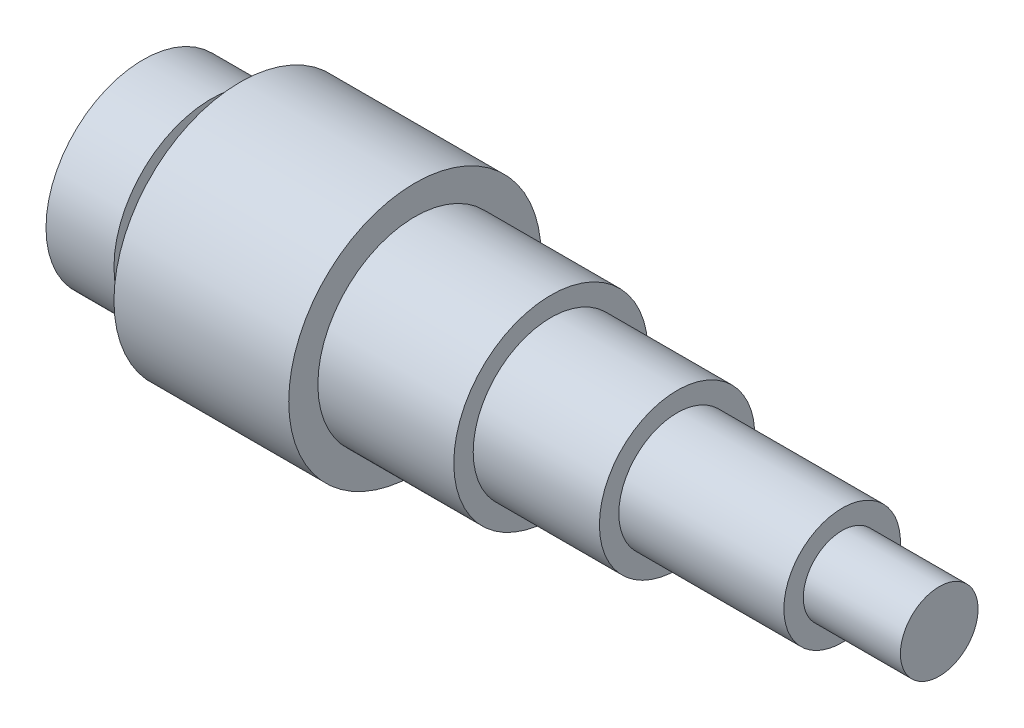
ISO-10303-21;
HEADER;
FILE_DESCRIPTION(('STEP AP214'),'2;1');
FILE_NAME('part.step','',(''),(''),'','','');
FILE_SCHEMA(('AUTOMOTIVE_DESIGN { 1 0 10303 214 1 1 1 1 }'));
ENDSEC;
DATA;
#1=APPLICATION_CONTEXT('core data for automotive mechanical design processes');
#2=APPLICATION_PROTOCOL_DEFINITION('international standard','automotive_design',2000,#1);
#3=PRODUCT_CONTEXT('',#1,'mechanical');
#4=PRODUCT('Part','Part','',(#3));
#5=PRODUCT_RELATED_PRODUCT_CATEGORY('part','',(#4));
#6=PRODUCT_DEFINITION_FORMATION('','',#4);
#7=PRODUCT_DEFINITION_CONTEXT('part definition',#1,'design');
#8=PRODUCT_DEFINITION('design','',#6,#7);
#9=PRODUCT_DEFINITION_SHAPE('','',#8);
#10=(LENGTH_UNIT() NAMED_UNIT(*) SI_UNIT(.MILLI.,.METRE.));
#11=(NAMED_UNIT(*) PLANE_ANGLE_UNIT() SI_UNIT($,.RADIAN.));
#12=(NAMED_UNIT(*) SI_UNIT($,.STERADIAN.) SOLID_ANGLE_UNIT());
#13=UNCERTAINTY_MEASURE_WITH_UNIT(LENGTH_MEASURE(1.E-05),#10,'distance_accuracy_value','');
#14=(GEOMETRIC_REPRESENTATION_CONTEXT(3) GLOBAL_UNCERTAINTY_ASSIGNED_CONTEXT((#13)) GLOBAL_UNIT_ASSIGNED_CONTEXT((#10,
#11,#12)) REPRESENTATION_CONTEXT('',''));
#15=CARTESIAN_POINT('',(0.,0.,0.));
#16=DIRECTION('',(0.,0.,1.));
#17=DIRECTION('',(1.,0.,0.));
#18=AXIS2_PLACEMENT_3D('',#15,#16,#17);
#19=CARTESIAN_POINT('',(3.5,0.,0.));
#20=DIRECTION('',(-1.,0.,0.));
#21=DIRECTION('',(0.,0.,1.));
#22=AXIS2_PLACEMENT_3D('',#19,#20,#21);
#23=PLANE('',#22);
#24=CARTESIAN_POINT('',(3.5,0.,0.));
#25=DIRECTION('',(-1.,0.,0.));
#26=DIRECTION('',(0.,0.,1.));
#27=AXIS2_PLACEMENT_3D('',#24,#25,#26);
#28=CIRCLE('',#27,10.);
#29=CARTESIAN_POINT('',(3.5,0.,10.));
#30=VERTEX_POINT('',#29);
#31=EDGE_CURVE('E69',#30,#30,#28,.T.);
#32=ORIENTED_EDGE('',*,*,#31,.F.);
#33=EDGE_LOOP('',(#32));
#34=FACE_BOUND('',#33,.T.);
#35=CARTESIAN_POINT('',(3.5,0.,0.));
#36=DIRECTION('',(-1.,0.,0.));
#37=DIRECTION('',(0.,0.,1.));
#38=AXIS2_PLACEMENT_3D('',#35,#36,#37);
#39=CIRCLE('',#38,8.);
#40=CARTESIAN_POINT('',(3.5,0.,8.));
#41=VERTEX_POINT('',#40);
#42=EDGE_CURVE('E11',#41,#41,#39,.T.);
#43=ORIENTED_EDGE('',*,*,#42,.T.);
#44=EDGE_LOOP('',(#43));
#45=FACE_BOUND('',#44,.T.);
#46=ADVANCED_FACE('F45',(#34,#45),#23,.F.);
#47=CARTESIAN_POINT('',(-3.5,0.,0.));
#48=DIRECTION('',(-1.,0.,0.));
#49=DIRECTION('',(0.,0.,1.));
#50=AXIS2_PLACEMENT_3D('',#47,#48,#49);
#51=CYLINDRICAL_SURFACE('',#50,8.);
#52=CARTESIAN_POINT('',(6.5,0.,0.));
#53=DIRECTION('',(-1.,0.,0.));
#54=DIRECTION('',(0.,0.,1.));
#55=AXIS2_PLACEMENT_3D('',#52,#53,#54);
#56=CIRCLE('',#55,8.);
#57=CARTESIAN_POINT('',(6.5,0.,8.));
#58=VERTEX_POINT('',#57);
#59=EDGE_CURVE('E52',#58,#58,#56,.T.);
#60=ORIENTED_EDGE('',*,*,#59,.T.);
#61=EDGE_LOOP('',(#60));
#62=FACE_BOUND('',#61,.T.);
#63=ORIENTED_EDGE('',*,*,#42,.F.);
#64=EDGE_LOOP('',(#63));
#65=FACE_BOUND('',#64,.T.);
#66=ADVANCED_FACE('F122',(#62,#65),#51,.T.);
#67=CARTESIAN_POINT('',(6.5,0.,0.));
#68=DIRECTION('',(-1.,0.,0.));
#69=DIRECTION('',(0.,0.,1.));
#70=AXIS2_PLACEMENT_3D('',#67,#68,#69);
#71=PLANE('',#70);
#72=CARTESIAN_POINT('',(6.5,0.,0.));
#73=DIRECTION('',(-1.,0.,0.));
#74=DIRECTION('',(0.,0.,1.));
#75=AXIS2_PLACEMENT_3D('',#72,#73,#74);
#76=CIRCLE('',#75,13.);
#77=CARTESIAN_POINT('',(6.5,0.,13.));
#78=VERTEX_POINT('',#77);
#79=EDGE_CURVE('E115',#78,#78,#76,.T.);
#80=ORIENTED_EDGE('',*,*,#79,.T.);
#81=EDGE_LOOP('',(#80));
#82=FACE_BOUND('',#81,.T.);
#83=ORIENTED_EDGE('',*,*,#59,.F.);
#84=EDGE_LOOP('',(#83));
#85=FACE_BOUND('',#84,.T.);
#86=ADVANCED_FACE('F125',(#82,#85),#71,.T.);
#87=CARTESIAN_POINT('',(-3.5,0.,0.));
#88=DIRECTION('',(-1.,0.,0.));
#89=DIRECTION('',(0.,0.,1.));
#90=AXIS2_PLACEMENT_3D('',#87,#88,#89);
#91=CYLINDRICAL_SURFACE('',#90,13.);
#92=CARTESIAN_POINT('',(24.5,0.,0.));
#93=DIRECTION('',(-1.,0.,0.));
#94=DIRECTION('',(0.,0.,1.));
#95=AXIS2_PLACEMENT_3D('',#92,#93,#94);
#96=CIRCLE('',#95,13.);
#97=CARTESIAN_POINT('',(24.5,0.,13.));
#98=VERTEX_POINT('',#97);
#99=EDGE_CURVE('E111',#98,#98,#96,.T.);
#100=ORIENTED_EDGE('',*,*,#99,.T.);
#101=EDGE_LOOP('',(#100));
#102=FACE_BOUND('',#101,.T.);
#103=ORIENTED_EDGE('',*,*,#79,.F.);
#104=EDGE_LOOP('',(#103));
#105=FACE_BOUND('',#104,.T.);
#106=ADVANCED_FACE('F127',(#102,#105),#91,.T.);
#107=CARTESIAN_POINT('',(24.5,0.,0.));
#108=DIRECTION('',(-1.,0.,0.));
#109=DIRECTION('',(0.,0.,1.));
#110=AXIS2_PLACEMENT_3D('',#107,#108,#109);
#111=PLANE('',#110);
#112=ORIENTED_EDGE('',*,*,#99,.F.);
#113=EDGE_LOOP('',(#112));
#114=FACE_BOUND('',#113,.T.);
#115=CARTESIAN_POINT('',(24.5,0.,0.));
#116=DIRECTION('',(-1.,0.,0.));
#117=DIRECTION('',(0.,0.,1.));
#118=AXIS2_PLACEMENT_3D('',#115,#116,#117);
#119=CIRCLE('',#118,10.);
#120=CARTESIAN_POINT('',(24.5,0.,10.));
#121=VERTEX_POINT('',#120);
#122=EDGE_CURVE('E107',#121,#121,#119,.T.);
#123=ORIENTED_EDGE('',*,*,#122,.T.);
#124=EDGE_LOOP('',(#123));
#125=FACE_BOUND('',#124,.T.);
#126=ADVANCED_FACE('F134',(#114,#125),#111,.F.);
#127=CARTESIAN_POINT('',(-3.5,0.,0.));
#128=DIRECTION('',(-1.,0.,0.));
#129=DIRECTION('',(0.,0.,1.));
#130=AXIS2_PLACEMENT_3D('',#127,#128,#129);
#131=CYLINDRICAL_SURFACE('',#130,10.);
#132=CARTESIAN_POINT('',(38.5,0.,0.));
#133=DIRECTION('',(-1.,0.,0.));
#134=DIRECTION('',(0.,0.,1.));
#135=AXIS2_PLACEMENT_3D('',#132,#133,#134);
#136=CIRCLE('',#135,10.);
#137=CARTESIAN_POINT('',(38.5,0.,10.));
#138=VERTEX_POINT('',#137);
#139=EDGE_CURVE('E103',#138,#138,#136,.T.);
#140=ORIENTED_EDGE('',*,*,#139,.T.);
#141=EDGE_LOOP('',(#140));
#142=FACE_BOUND('',#141,.T.);
#143=ORIENTED_EDGE('',*,*,#122,.F.);
#144=EDGE_LOOP('',(#143));
#145=FACE_BOUND('',#144,.T.);
#146=ADVANCED_FACE('F187',(#142,#145),#131,.T.);
#147=CARTESIAN_POINT('',(38.5,0.,0.));
#148=DIRECTION('',(-1.,0.,0.));
#149=DIRECTION('',(0.,0.,1.));
#150=AXIS2_PLACEMENT_3D('',#147,#148,#149);
#151=PLANE('',#150);
#152=ORIENTED_EDGE('',*,*,#139,.F.);
#153=EDGE_LOOP('',(#152));
#154=FACE_BOUND('',#153,.T.);
#155=CARTESIAN_POINT('',(38.5,0.,0.));
#156=DIRECTION('',(-1.,0.,0.));
#157=DIRECTION('',(0.,0.,1.));
#158=AXIS2_PLACEMENT_3D('',#155,#156,#157);
#159=CIRCLE('',#158,8.);
#160=CARTESIAN_POINT('',(38.5,0.,8.));
#161=VERTEX_POINT('',#160);
#162=EDGE_CURVE('E99',#161,#161,#159,.T.);
#163=ORIENTED_EDGE('',*,*,#162,.T.);
#164=EDGE_LOOP('',(#163));
#165=FACE_BOUND('',#164,.T.);
#166=ADVANCED_FACE('F183',(#154,#165),#151,.F.);
#167=CARTESIAN_POINT('',(-3.5,0.,0.));
#168=DIRECTION('',(-1.,0.,0.));
#169=DIRECTION('',(0.,0.,1.));
#170=AXIS2_PLACEMENT_3D('',#167,#168,#169);
#171=CYLINDRICAL_SURFACE('',#170,8.);
#172=CARTESIAN_POINT('',(51.5,0.,0.));
#173=DIRECTION('',(-1.,0.,0.));
#174=DIRECTION('',(0.,0.,1.));
#175=AXIS2_PLACEMENT_3D('',#172,#173,#174);
#176=CIRCLE('',#175,8.);
#177=CARTESIAN_POINT('',(51.5,0.,8.));
#178=VERTEX_POINT('',#177);
#179=EDGE_CURVE('E95',#178,#178,#176,.T.);
#180=ORIENTED_EDGE('',*,*,#179,.T.);
#181=EDGE_LOOP('',(#180));
#182=FACE_BOUND('',#181,.T.);
#183=ORIENTED_EDGE('',*,*,#162,.F.);
#184=EDGE_LOOP('',(#183));
#185=FACE_BOUND('',#184,.T.);
#186=ADVANCED_FACE('F179',(#182,#185),#171,.T.);
#187=CARTESIAN_POINT('',(51.5,0.,0.));
#188=DIRECTION('',(-1.,0.,0.));
#189=DIRECTION('',(0.,0.,1.));
#190=AXIS2_PLACEMENT_3D('',#187,#188,#189);
#191=PLANE('',#190);
#192=ORIENTED_EDGE('',*,*,#179,.F.);
#193=EDGE_LOOP('',(#192));
#194=FACE_BOUND('',#193,.T.);
#195=CARTESIAN_POINT('',(51.5,0.,0.));
#196=DIRECTION('',(-1.,0.,0.));
#197=DIRECTION('',(0.,0.,1.));
#198=AXIS2_PLACEMENT_3D('',#195,#196,#197);
#199=CIRCLE('',#198,6.);
#200=CARTESIAN_POINT('',(51.5,0.,6.));
#201=VERTEX_POINT('',#200);
#202=EDGE_CURVE('E91',#201,#201,#199,.T.);
#203=ORIENTED_EDGE('',*,*,#202,.T.);
#204=EDGE_LOOP('',(#203));
#205=FACE_BOUND('',#204,.T.);
#206=ADVANCED_FACE('F175',(#194,#205),#191,.F.);
#207=CARTESIAN_POINT('',(-3.5,0.,0.));
#208=DIRECTION('',(-1.,0.,0.));
#209=DIRECTION('',(0.,0.,1.));
#210=AXIS2_PLACEMENT_3D('',#207,#208,#209);
#211=CYLINDRICAL_SURFACE('',#210,6.);
#212=CARTESIAN_POINT('',(68.5,0.,0.));
#213=DIRECTION('',(-1.,0.,0.));
#214=DIRECTION('',(0.,0.,1.));
#215=AXIS2_PLACEMENT_3D('',#212,#213,#214);
#216=CIRCLE('',#215,6.);
#217=CARTESIAN_POINT('',(68.5,0.,6.));
#218=VERTEX_POINT('',#217);
#219=EDGE_CURVE('E87',#218,#218,#216,.T.);
#220=ORIENTED_EDGE('',*,*,#219,.T.);
#221=EDGE_LOOP('',(#220));
#222=FACE_BOUND('',#221,.T.);
#223=ORIENTED_EDGE('',*,*,#202,.F.);
#224=EDGE_LOOP('',(#223));
#225=FACE_BOUND('',#224,.T.);
#226=ADVANCED_FACE('F171',(#222,#225),#211,.T.);
#227=CARTESIAN_POINT('',(68.5,0.,0.));
#228=DIRECTION('',(-1.,0.,0.));
#229=DIRECTION('',(0.,0.,1.));
#230=AXIS2_PLACEMENT_3D('',#227,#228,#229);
#231=PLANE('',#230);
#232=ORIENTED_EDGE('',*,*,#219,.F.);
#233=EDGE_LOOP('',(#232));
#234=FACE_BOUND('',#233,.T.);
#235=CARTESIAN_POINT('',(68.5,0.,0.));
#236=DIRECTION('',(-1.,0.,0.));
#237=DIRECTION('',(0.,0.,1.));
#238=AXIS2_PLACEMENT_3D('',#235,#236,#237);
#239=CIRCLE('',#238,4.);
#240=CARTESIAN_POINT('',(68.5,0.,4.));
#241=VERTEX_POINT('',#240);
#242=EDGE_CURVE('E83',#241,#241,#239,.T.);
#243=ORIENTED_EDGE('',*,*,#242,.T.);
#244=EDGE_LOOP('',(#243));
#245=FACE_BOUND('',#244,.T.);
#246=ADVANCED_FACE('F167',(#234,#245),#231,.F.);
#247=CARTESIAN_POINT('',(-3.5,0.,0.));
#248=DIRECTION('',(-1.,0.,0.));
#249=DIRECTION('',(0.,0.,1.));
#250=AXIS2_PLACEMENT_3D('',#247,#248,#249);
#251=CYLINDRICAL_SURFACE('',#250,4.);
#252=CARTESIAN_POINT('',(78.5,0.,0.));
#253=DIRECTION('',(-1.,0.,0.));
#254=DIRECTION('',(0.,0.,1.));
#255=AXIS2_PLACEMENT_3D('',#252,#253,#254);
#256=CIRCLE('',#255,4.);
#257=CARTESIAN_POINT('',(78.5,0.,4.));
#258=VERTEX_POINT('',#257);
#259=EDGE_CURVE('E79',#258,#258,#256,.T.);
#260=ORIENTED_EDGE('',*,*,#259,.T.);
#261=EDGE_LOOP('',(#260));
#262=FACE_BOUND('',#261,.T.);
#263=ORIENTED_EDGE('',*,*,#242,.F.);
#264=EDGE_LOOP('',(#263));
#265=FACE_BOUND('',#264,.T.);
#266=ADVANCED_FACE('F159',(#262,#265),#251,.T.);
#267=CARTESIAN_POINT('',(78.5,0.,0.));
#268=DIRECTION('',(1.,0.,0.));
#269=DIRECTION('',(0.,0.,-1.));
#270=AXIS2_PLACEMENT_3D('',#267,#268,#269);
#271=PLANE('',#270);
#272=ORIENTED_EDGE('',*,*,#259,.F.);
#273=EDGE_LOOP('',(#272));
#274=FACE_BOUND('',#273,.T.);
#275=ADVANCED_FACE('F153',(#274),#271,.T.);
#276=CARTESIAN_POINT('',(-3.5,0.,0.));
#277=DIRECTION('',(-1.,0.,0.));
#278=DIRECTION('',(0.,0.,1.));
#279=AXIS2_PLACEMENT_3D('',#276,#277,#278);
#280=PLANE('',#279);
#281=CARTESIAN_POINT('',(-3.5,0.,0.));
#282=DIRECTION('',(-1.,0.,0.));
#283=DIRECTION('',(0.,0.,1.));
#284=AXIS2_PLACEMENT_3D('',#281,#282,#283);
#285=CIRCLE('',#284,2.5);
#286=CARTESIAN_POINT('',(-3.5,0.,2.5));
#287=VERTEX_POINT('',#286);
#288=EDGE_CURVE('E65',#287,#287,#285,.T.);
#289=ORIENTED_EDGE('',*,*,#288,.F.);
#290=EDGE_LOOP('',(#289));
#291=FACE_BOUND('',#290,.T.);
#292=CARTESIAN_POINT('',(-3.5,0.,0.));
#293=DIRECTION('',(-1.,0.,0.));
#294=DIRECTION('',(0.,0.,1.));
#295=AXIS2_PLACEMENT_3D('',#292,#293,#294);
#296=CIRCLE('',#295,10.);
#297=CARTESIAN_POINT('',(-3.5,0.,10.));
#298=VERTEX_POINT('',#297);
#299=EDGE_CURVE('E75',#298,#298,#296,.T.);
#300=ORIENTED_EDGE('',*,*,#299,.T.);
#301=EDGE_LOOP('',(#300));
#302=FACE_BOUND('',#301,.T.);
#303=ADVANCED_FACE('F148',(#291,#302),#280,.T.);
#304=CARTESIAN_POINT('',(-3.5,0.,0.));
#305=DIRECTION('',(-1.,0.,0.));
#306=DIRECTION('',(0.,0.,1.));
#307=AXIS2_PLACEMENT_3D('',#304,#305,#306);
#308=CYLINDRICAL_SURFACE('',#307,10.);
#309=ORIENTED_EDGE('',*,*,#31,.T.);
#310=EDGE_LOOP('',(#309));
#311=FACE_BOUND('',#310,.T.);
#312=ORIENTED_EDGE('',*,*,#299,.F.);
#313=EDGE_LOOP('',(#312));
#314=FACE_BOUND('',#313,.T.);
#315=ADVANCED_FACE('F145',(#311,#314),#308,.T.);
#316=CARTESIAN_POINT('',(32.5,0.,0.));
#317=DIRECTION('',(-1.,0.,0.));
#318=DIRECTION('',(0.,0.,1.));
#319=AXIS2_PLACEMENT_3D('',#316,#317,#318);
#320=CYLINDRICAL_SURFACE('',#319,2.5);
#321=CARTESIAN_POINT('',(32.5,0.,0.));
#322=DIRECTION('',(1.,0.,0.));
#323=DIRECTION('',(0.,1.,0.));
#324=AXIS2_PLACEMENT_3D('',#321,#322,#323);
#325=CIRCLE('',#324,2.50000000000008);
#326=CARTESIAN_POINT('',(32.4999999999999,2.50000000000017,0.));
#327=VERTEX_POINT('',#326);
#328=EDGE_CURVE('E62',#327,#327,#325,.T.);
#329=ORIENTED_EDGE('',*,*,#328,.T.);
#330=EDGE_LOOP('',(#329));
#331=FACE_BOUND('',#330,.T.);
#332=ORIENTED_EDGE('',*,*,#288,.T.);
#333=EDGE_LOOP('',(#332));
#334=FACE_BOUND('',#333,.T.);
#335=ADVANCED_FACE('F58',(#331,#334),#320,.F.);
#336=CARTESIAN_POINT('',(32.5,0.,0.));
#337=DIRECTION('',(-1.,0.,0.));
#338=DIRECTION('',(0.,-1.,0.));
#339=AXIS2_PLACEMENT_3D('',#336,#337,#338);
#340=CONICAL_SURFACE('',#339,2.50000000000008,0.896055384571384);
#341=CARTESIAN_POINT('',(34.4999999999999,1.21430643318376E-13,0.));
#342=VERTEX_POINT('',#341);
#343=VERTEX_LOOP('',#342);
#344=FACE_BOUND('',#343,.T.);
#345=ORIENTED_EDGE('',*,*,#328,.F.);
#346=EDGE_LOOP('',(#345));
#347=FACE_BOUND('',#346,.T.);
#348=ADVANCED_FACE('F55',(#344,#347),#340,.F.);
#349=CLOSED_SHELL('',(#46,#66,#86,#106,#126,#146,#166,#186,#206,#226,#246,#266,#275,#303,#315,
#335,#348));
#350=MANIFOLD_SOLID_BREP('B2',#349);
#351=ADVANCED_BREP_SHAPE_REPRESENTATION('',(#18,#350),#14);
#352=SHAPE_DEFINITION_REPRESENTATION(#9,#351);
ENDSEC;
END-ISO-10303-21;
